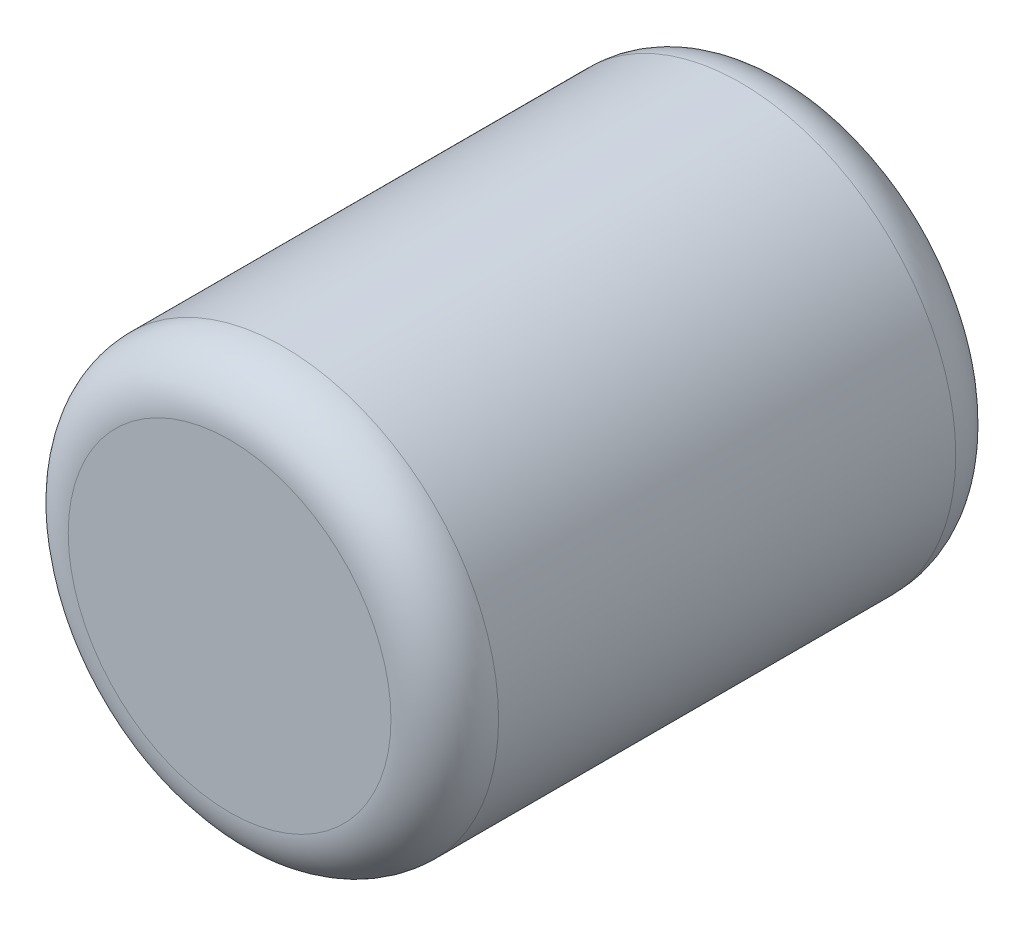
ISO-10303-21;
HEADER;
FILE_DESCRIPTION(('STEP AP214'),'2;1');
FILE_NAME('part.step','',(''),(''),'','','');
FILE_SCHEMA(('AUTOMOTIVE_DESIGN { 1 0 10303 214 1 1 1 1 }'));
ENDSEC;
DATA;
#1=APPLICATION_CONTEXT('core data for automotive mechanical design processes');
#2=APPLICATION_PROTOCOL_DEFINITION('international standard','automotive_design',2000,#1);
#3=PRODUCT_CONTEXT('',#1,'mechanical');
#4=PRODUCT('Part','Part','',(#3));
#5=PRODUCT_RELATED_PRODUCT_CATEGORY('part','',(#4));
#6=PRODUCT_DEFINITION_FORMATION('','',#4);
#7=PRODUCT_DEFINITION_CONTEXT('part definition',#1,'design');
#8=PRODUCT_DEFINITION('design','',#6,#7);
#9=PRODUCT_DEFINITION_SHAPE('','',#8);
#10=(LENGTH_UNIT() NAMED_UNIT(*) SI_UNIT(.MILLI.,.METRE.));
#11=(NAMED_UNIT(*) PLANE_ANGLE_UNIT() SI_UNIT($,.RADIAN.));
#12=(NAMED_UNIT(*) SI_UNIT($,.STERADIAN.) SOLID_ANGLE_UNIT());
#13=UNCERTAINTY_MEASURE_WITH_UNIT(LENGTH_MEASURE(1.E-05),#10,'distance_accuracy_value','');
#14=(GEOMETRIC_REPRESENTATION_CONTEXT(3) GLOBAL_UNCERTAINTY_ASSIGNED_CONTEXT((#13)) GLOBAL_UNIT_ASSIGNED_CONTEXT((#10,
#11,#12)) REPRESENTATION_CONTEXT('',''));
#15=CARTESIAN_POINT('',(0.,0.,0.));
#16=DIRECTION('',(0.,0.,1.));
#17=DIRECTION('',(1.,0.,0.));
#18=AXIS2_PLACEMENT_3D('',#15,#16,#17);
#19=CARTESIAN_POINT('',(0.,0.,133.35));
#20=DIRECTION('',(0.,0.,-1.));
#21=DIRECTION('',(-1.,0.,0.));
#22=AXIS2_PLACEMENT_3D('',#19,#20,#21);
#23=CYLINDRICAL_SURFACE('',#22,50.8);
#24=CARTESIAN_POINT('',(0.,0.,12.7));
#25=DIRECTION('',(0.,0.,1.));
#26=DIRECTION('',(1.,0.,0.));
#27=AXIS2_PLACEMENT_3D('',#24,#25,#26);
#28=CIRCLE('',#27,50.8);
#29=CARTESIAN_POINT('',(50.8,0.,12.7));
#30=VERTEX_POINT('',#29);
#31=EDGE_CURVE('E50',#30,#30,#28,.T.);
#32=ORIENTED_EDGE('',*,*,#31,.T.);
#33=EDGE_LOOP('',(#32));
#34=FACE_BOUND('',#33,.T.);
#35=CARTESIAN_POINT('',(0.,0.,120.65));
#36=DIRECTION('',(0.,0.,1.));
#37=DIRECTION('',(1.,0.,0.));
#38=AXIS2_PLACEMENT_3D('',#35,#36,#37);
#39=CIRCLE('',#38,50.8);
#40=CARTESIAN_POINT('',(50.8,0.,120.65));
#41=VERTEX_POINT('',#40);
#42=EDGE_CURVE('E54',#41,#41,#39,.F.);
#43=ORIENTED_EDGE('',*,*,#42,.T.);
#44=EDGE_LOOP('',(#43));
#45=FACE_BOUND('',#44,.T.);
#46=ADVANCED_FACE('F39',(#34,#45),#23,.T.);
#47=CARTESIAN_POINT('',(0.,0.,133.35));
#48=DIRECTION('',(0.,0.,1.));
#49=DIRECTION('',(1.,0.,0.));
#50=AXIS2_PLACEMENT_3D('',#47,#48,#49);
#51=PLANE('',#50);
#52=CARTESIAN_POINT('',(0.,0.,133.35));
#53=DIRECTION('',(0.,0.,1.));
#54=DIRECTION('',(1.,0.,0.));
#55=AXIS2_PLACEMENT_3D('',#52,#53,#54);
#56=CIRCLE('',#55,38.1);
#57=CARTESIAN_POINT('',(38.1,0.,133.35));
#58=VERTEX_POINT('',#57);
#59=EDGE_CURVE('E10',#58,#58,#56,.T.);
#60=ORIENTED_EDGE('',*,*,#59,.T.);
#61=EDGE_LOOP('',(#60));
#62=FACE_BOUND('',#61,.T.);
#63=ADVANCED_FACE('F70',(#62),#51,.T.);
#64=CARTESIAN_POINT('',(0.,0.,0.));
#65=DIRECTION('',(0.,0.,1.));
#66=DIRECTION('',(1.,0.,0.));
#67=AXIS2_PLACEMENT_3D('',#64,#65,#66);
#68=PLANE('',#67);
#69=CARTESIAN_POINT('',(0.,0.,0.));
#70=DIRECTION('',(0.,0.,1.));
#71=DIRECTION('',(1.,0.,0.));
#72=AXIS2_PLACEMENT_3D('',#69,#70,#71);
#73=CIRCLE('',#72,38.1);
#74=CARTESIAN_POINT('',(38.1,0.,0.));
#75=VERTEX_POINT('',#74);
#76=EDGE_CURVE('E46',#75,#75,#73,.F.);
#77=ORIENTED_EDGE('',*,*,#76,.T.);
#78=EDGE_LOOP('',(#77));
#79=FACE_BOUND('',#78,.T.);
#80=ADVANCED_FACE('F67',(#79),#68,.F.);
#81=CARTESIAN_POINT('',(0.,0.,12.7));
#82=DIRECTION('',(0.,0.,1.));
#83=DIRECTION('',(1.,0.,0.));
#84=AXIS2_PLACEMENT_3D('',#81,#82,#83);
#85=TOROIDAL_SURFACE('',#84,38.1,12.7);
#86=ORIENTED_EDGE('',*,*,#76,.F.);
#87=EDGE_LOOP('',(#86));
#88=FACE_BOUND('',#87,.T.);
#89=ORIENTED_EDGE('',*,*,#31,.F.);
#90=EDGE_LOOP('',(#89));
#91=FACE_BOUND('',#90,.T.);
#92=ADVANCED_FACE('F63',(#88,#91),#85,.T.);
#93=CARTESIAN_POINT('',(0.,0.,120.65));
#94=DIRECTION('',(0.,0.,1.));
#95=DIRECTION('',(1.,0.,0.));
#96=AXIS2_PLACEMENT_3D('',#93,#94,#95);
#97=TOROIDAL_SURFACE('',#96,38.1,12.7);
#98=ORIENTED_EDGE('',*,*,#42,.F.);
#99=EDGE_LOOP('',(#98));
#100=FACE_BOUND('',#99,.T.);
#101=ORIENTED_EDGE('',*,*,#59,.F.);
#102=EDGE_LOOP('',(#101));
#103=FACE_BOUND('',#102,.T.);
#104=ADVANCED_FACE('F41',(#100,#103),#97,.T.);
#105=CLOSED_SHELL('',(#46,#63,#80,#92,#104));
#106=MANIFOLD_SOLID_BREP('B2',#105);
#107=ADVANCED_BREP_SHAPE_REPRESENTATION('',(#18,#106),#14);
#108=SHAPE_DEFINITION_REPRESENTATION(#9,#107);
ENDSEC;
END-ISO-10303-21;
